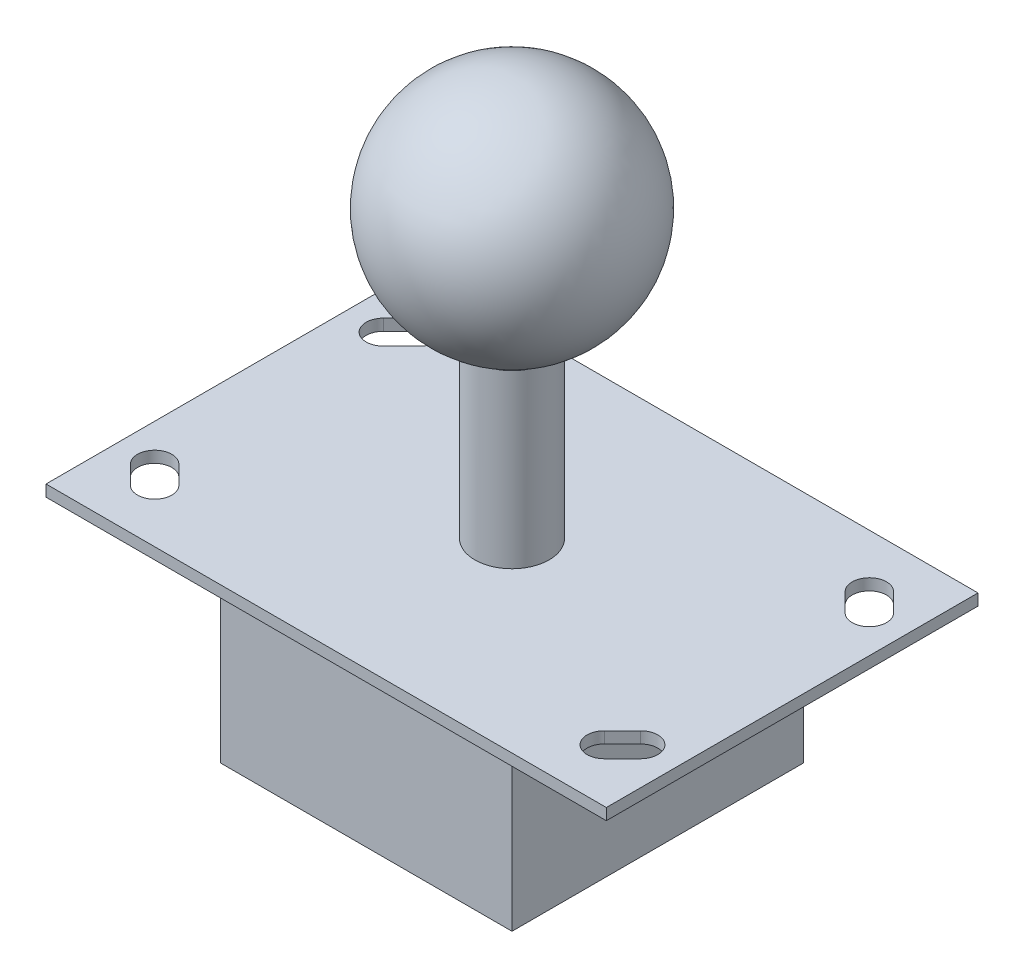
ISO-10303-21;
HEADER;
FILE_DESCRIPTION(('STEP AP214'),'2;1');
FILE_NAME('part.step','',(''),(''),'','','');
FILE_SCHEMA(('AUTOMOTIVE_DESIGN { 1 0 10303 214 1 1 1 1 }'));
ENDSEC;
DATA;
#1=APPLICATION_CONTEXT('core data for automotive mechanical design processes');
#2=APPLICATION_PROTOCOL_DEFINITION('international standard','automotive_design',2000,#1);
#3=PRODUCT_CONTEXT('',#1,'mechanical');
#4=PRODUCT('Part','Part','',(#3));
#5=PRODUCT_RELATED_PRODUCT_CATEGORY('part','',(#4));
#6=PRODUCT_DEFINITION_FORMATION('','',#4);
#7=PRODUCT_DEFINITION_CONTEXT('part definition',#1,'design');
#8=PRODUCT_DEFINITION('design','',#6,#7);
#9=PRODUCT_DEFINITION_SHAPE('','',#8);
#10=(LENGTH_UNIT() NAMED_UNIT(*) SI_UNIT(.MILLI.,.METRE.));
#11=(NAMED_UNIT(*) PLANE_ANGLE_UNIT() SI_UNIT($,.RADIAN.));
#12=(NAMED_UNIT(*) SI_UNIT($,.STERADIAN.) SOLID_ANGLE_UNIT());
#13=UNCERTAINTY_MEASURE_WITH_UNIT(LENGTH_MEASURE(1.E-05),#10,'distance_accuracy_value','');
#14=(GEOMETRIC_REPRESENTATION_CONTEXT(3) GLOBAL_UNCERTAINTY_ASSIGNED_CONTEXT((#13)) GLOBAL_UNIT_ASSIGNED_CONTEXT((#10,
#11,#12)) REPRESENTATION_CONTEXT('',''));
#15=CARTESIAN_POINT('',(0.,0.,0.));
#16=DIRECTION('',(0.,0.,1.));
#17=DIRECTION('',(1.,0.,0.));
#18=AXIS2_PLACEMENT_3D('',#15,#16,#17);
#19=CARTESIAN_POINT('',(0.,50.,0.));
#20=DIRECTION('',(0.,-1.,0.));
#21=DIRECTION('',(-1.,0.,0.));
#22=AXIS2_PLACEMENT_3D('',#19,#20,#21);
#23=SPHERICAL_SURFACE('',#22,20.);
#24=CARTESIAN_POINT('',(0.,30.,0.));
#25=VERTEX_POINT('',#24);
#26=VERTEX_LOOP('',#25);
#27=FACE_BOUND('',#26,.T.);
#28=ADVANCED_FACE('F41',(#27),#23,.T.);
#29=CLOSED_SHELL('',(#28));
#30=MANIFOLD_SOLID_BREP('B2',#29);
#31=CARTESIAN_POINT('',(0.,-2.,0.));
#32=DIRECTION('',(0.,-1.,0.));
#33=DIRECTION('',(0.,0.,-1.));
#34=AXIS2_PLACEMENT_3D('',#31,#32,#33);
#35=PLANE('',#34);
#36=CARTESIAN_POINT('',(-39.3180194846605,-2.,23.1819805153395));
#37=DIRECTION('',(0.,-1.,0.));
#38=DIRECTION('',(0.,0.,-1.));
#39=AXIS2_PLACEMENT_3D('',#36,#37,#38);
#40=CIRCLE('',#39,3.);
#41=CARTESIAN_POINT('',(-37.1966991411009,-2.,21.0606601717798));
#42=VERTEX_POINT('',#41);
#43=CARTESIAN_POINT('',(-41.4393398282202,-2.,25.3033008588991));
#44=VERTEX_POINT('',#43);
#45=EDGE_CURVE('E306',#42,#44,#40,.T.);
#46=ORIENTED_EDGE('',*,*,#45,.F.);
#47=DIRECTION('',(0.707106781186549,0.,0.707106781186546));
#48=VECTOR('',#47,1.);
#49=CARTESIAN_POINT('',(-29.1286796564403,-2.,29.1286796564404));
#50=LINE('',#49,#48);
#51=CARTESIAN_POINT('',(-40.3786796564404,-2.,17.8786796564404));
#52=VERTEX_POINT('',#51);
#53=EDGE_CURVE('E301',#52,#42,#50,.T.);
#54=ORIENTED_EDGE('',*,*,#53,.F.);
#55=CARTESIAN_POINT('',(-42.5,-2.,20.));
#56=DIRECTION('',(0.,-1.,0.));
#57=DIRECTION('',(0.,0.,-1.));
#58=AXIS2_PLACEMENT_3D('',#55,#56,#57);
#59=CIRCLE('',#58,3.);
#60=CARTESIAN_POINT('',(-44.6213203435596,-2.,22.1213203435597));
#61=VERTEX_POINT('',#60);
#62=EDGE_CURVE('E220',#61,#52,#59,.T.);
#63=ORIENTED_EDGE('',*,*,#62,.F.);
#64=DIRECTION('',(-0.70710678118655,0.,-0.707106781186545));
#65=VECTOR('',#64,1.);
#66=CARTESIAN_POINT('',(-33.3713203435595,-2.,33.3713203435597));
#67=LINE('',#66,#65);
#68=EDGE_CURVE('E304',#44,#61,#67,.T.);
#69=ORIENTED_EDGE('',*,*,#68,.F.);
#70=EDGE_LOOP('',(#46,#54,#63,#69));
#71=FACE_BOUND('',#70,.T.);
#72=CARTESIAN_POINT('',(39.3180194846605,-2.,23.1819805153394));
#73=DIRECTION('',(0.,-1.,0.));
#74=DIRECTION('',(0.,0.,-1.));
#75=AXIS2_PLACEMENT_3D('',#72,#73,#74);
#76=CIRCLE('',#75,3.);
#77=CARTESIAN_POINT('',(41.4393398282202,-2.,25.3033008588991));
#78=VERTEX_POINT('',#77);
#79=CARTESIAN_POINT('',(37.1966991411009,-2.,21.0606601717798));
#80=VERTEX_POINT('',#79);
#81=EDGE_CURVE('E299',#78,#80,#76,.T.);
#82=ORIENTED_EDGE('',*,*,#81,.F.);
#83=DIRECTION('',(-0.70710678118655,0.,0.707106781186545));
#84=VECTOR('',#83,1.);
#85=CARTESIAN_POINT('',(33.3713203435595,-2.,33.3713203435597));
#86=LINE('',#85,#84);
#87=CARTESIAN_POINT('',(44.6213203435596,-2.,22.1213203435596));
#88=VERTEX_POINT('',#87);
#89=EDGE_CURVE('E293',#88,#78,#86,.T.);
#90=ORIENTED_EDGE('',*,*,#89,.F.);
#91=CARTESIAN_POINT('',(42.5,-2.,20.));
#92=DIRECTION('',(0.,-1.,0.));
#93=DIRECTION('',(0.,0.,-1.));
#94=AXIS2_PLACEMENT_3D('',#91,#92,#93);
#95=CIRCLE('',#94,3.);
#96=CARTESIAN_POINT('',(40.3786796564404,-2.,17.8786796564404));
#97=VERTEX_POINT('',#96);
#98=EDGE_CURVE('E295',#97,#88,#95,.T.);
#99=ORIENTED_EDGE('',*,*,#98,.F.);
#100=DIRECTION('',(0.707106781186549,0.,-0.707106781186546));
#101=VECTOR('',#100,1.);
#102=CARTESIAN_POINT('',(29.1286796564403,-2.,29.1286796564404));
#103=LINE('',#102,#101);
#104=EDGE_CURVE('E297',#80,#97,#103,.T.);
#105=ORIENTED_EDGE('',*,*,#104,.F.);
#106=EDGE_LOOP('',(#82,#90,#99,#105));
#107=FACE_BOUND('',#106,.T.);
#108=CARTESIAN_POINT('',(42.5,-2.,-20.));
#109=DIRECTION('',(0.,-1.,0.));
#110=DIRECTION('',(0.,0.,-1.));
#111=AXIS2_PLACEMENT_3D('',#108,#109,#110);
#112=CIRCLE('',#111,3.);
#113=CARTESIAN_POINT('',(44.6213203435597,-2.,-22.1213203435596));
#114=VERTEX_POINT('',#113);
#115=CARTESIAN_POINT('',(40.3786796564404,-2.,-17.8786796564404));
#116=VERTEX_POINT('',#115);
#117=EDGE_CURVE('E291',#114,#116,#112,.T.);
#118=ORIENTED_EDGE('',*,*,#117,.F.);
#119=DIRECTION('',(0.70710678118655,0.,0.707106781186545));
#120=VECTOR('',#119,1.);
#121=CARTESIAN_POINT('',(33.3713203435595,-2.,-33.3713203435597));
#122=LINE('',#121,#120);
#123=CARTESIAN_POINT('',(41.4393398282202,-2.,-25.3033008588991));
#124=VERTEX_POINT('',#123);
#125=EDGE_CURVE('E244',#124,#114,#122,.T.);
#126=ORIENTED_EDGE('',*,*,#125,.F.);
#127=CARTESIAN_POINT('',(39.3180194846605,-2.,-23.1819805153394));
#128=DIRECTION('',(0.,-1.,0.));
#129=DIRECTION('',(0.,0.,-1.));
#130=AXIS2_PLACEMENT_3D('',#127,#128,#129);
#131=CIRCLE('',#130,3.);
#132=CARTESIAN_POINT('',(37.1966991411009,-2.,-21.0606601717798));
#133=VERTEX_POINT('',#132);
#134=EDGE_CURVE('E286',#133,#124,#131,.T.);
#135=ORIENTED_EDGE('',*,*,#134,.F.);
#136=DIRECTION('',(-0.707106781186549,0.,-0.707106781186546));
#137=VECTOR('',#136,1.);
#138=CARTESIAN_POINT('',(29.1286796564403,-2.,-29.1286796564404));
#139=LINE('',#138,#137);
#140=EDGE_CURVE('E289',#116,#133,#139,.T.);
#141=ORIENTED_EDGE('',*,*,#140,.F.);
#142=EDGE_LOOP('',(#118,#126,#135,#141));
#143=FACE_BOUND('',#142,.T.);
#144=CARTESIAN_POINT('',(-42.5,-2.,-20.));
#145=DIRECTION('',(0.,-1.,0.));
#146=DIRECTION('',(0.,0.,-1.));
#147=AXIS2_PLACEMENT_3D('',#144,#145,#146);
#148=CIRCLE('',#147,3.);
#149=CARTESIAN_POINT('',(-40.3786796564404,-2.,-17.8786796564404));
#150=VERTEX_POINT('',#149);
#151=CARTESIAN_POINT('',(-44.6213203435596,-2.,-22.1213203435596));
#152=VERTEX_POINT('',#151);
#153=EDGE_CURVE('E335',#150,#152,#148,.T.);
#154=ORIENTED_EDGE('',*,*,#153,.F.);
#155=DIRECTION('',(-0.707106781186549,0.,0.707106781186546));
#156=VECTOR('',#155,1.);
#157=CARTESIAN_POINT('',(-29.1286796564403,-2.,-29.1286796564404));
#158=LINE('',#157,#156);
#159=CARTESIAN_POINT('',(-37.1966991411009,-2.,-21.0606601717798));
#160=VERTEX_POINT('',#159);
#161=EDGE_CURVE('E322',#160,#150,#158,.T.);
#162=ORIENTED_EDGE('',*,*,#161,.F.);
#163=CARTESIAN_POINT('',(-39.3180194846605,-2.,-23.1819805153395));
#164=DIRECTION('',(0.,-1.,0.));
#165=DIRECTION('',(0.,0.,-1.));
#166=AXIS2_PLACEMENT_3D('',#163,#164,#165);
#167=CIRCLE('',#166,3.);
#168=CARTESIAN_POINT('',(-41.4393398282202,-2.,-25.3033008588991));
#169=VERTEX_POINT('',#168);
#170=EDGE_CURVE('E330',#169,#160,#167,.T.);
#171=ORIENTED_EDGE('',*,*,#170,.F.);
#172=DIRECTION('',(0.70710678118655,0.,-0.707106781186545));
#173=VECTOR('',#172,1.);
#174=CARTESIAN_POINT('',(-33.3713203435595,-2.,-33.3713203435597));
#175=LINE('',#174,#173);
#176=EDGE_CURVE('E333',#152,#169,#175,.T.);
#177=ORIENTED_EDGE('',*,*,#176,.F.);
#178=EDGE_LOOP('',(#154,#162,#171,#177));
#179=FACE_BOUND('',#178,.T.);
#180=DIRECTION('',(0.,0.,1.));
#181=VECTOR('',#180,1.);
#182=CARTESIAN_POINT('',(49.,-2.,-32.5));
#183=LINE('',#182,#181);
#184=CARTESIAN_POINT('',(49.,-2.,-32.5));
#185=VERTEX_POINT('',#184);
#186=CARTESIAN_POINT('',(49.,-2.,32.5));
#187=VERTEX_POINT('',#186);
#188=EDGE_CURVE('E367',#185,#187,#183,.T.);
#189=ORIENTED_EDGE('',*,*,#188,.T.);
#190=DIRECTION('',(-1.,0.,0.));
#191=VECTOR('',#190,1.);
#192=CARTESIAN_POINT('',(49.,-2.,32.5));
#193=LINE('',#192,#191);
#194=CARTESIAN_POINT('',(-49.,-2.,32.5));
#195=VERTEX_POINT('',#194);
#196=EDGE_CURVE('E370',#187,#195,#193,.T.);
#197=ORIENTED_EDGE('',*,*,#196,.T.);
#198=DIRECTION('',(0.,0.,-1.));
#199=VECTOR('',#198,1.);
#200=CARTESIAN_POINT('',(-49.,-2.,-32.5));
#201=LINE('',#200,#199);
#202=CARTESIAN_POINT('',(-49.,-2.,-32.5));
#203=VERTEX_POINT('',#202);
#204=EDGE_CURVE('E373',#195,#203,#201,.T.);
#205=ORIENTED_EDGE('',*,*,#204,.T.);
#206=DIRECTION('',(1.,0.,0.));
#207=VECTOR('',#206,1.);
#208=CARTESIAN_POINT('',(49.,-2.,-32.5));
#209=LINE('',#208,#207);
#210=EDGE_CURVE('E375',#203,#185,#209,.T.);
#211=ORIENTED_EDGE('',*,*,#210,.T.);
#212=EDGE_LOOP('',(#189,#197,#205,#211));
#213=FACE_BOUND('',#212,.T.);
#214=DIRECTION('',(1.,0.,0.));
#215=VECTOR('',#214,1.);
#216=CARTESIAN_POINT('',(-25.5,-2.,-25.5));
#217=LINE('',#216,#215);
#218=CARTESIAN_POINT('',(-25.5,-2.,-25.5));
#219=VERTEX_POINT('',#218);
#220=CARTESIAN_POINT('',(25.5,-2.,-25.5));
#221=VERTEX_POINT('',#220);
#222=EDGE_CURVE('E351',#219,#221,#217,.T.);
#223=ORIENTED_EDGE('',*,*,#222,.F.);
#224=DIRECTION('',(0.,0.,-1.));
#225=VECTOR('',#224,1.);
#226=CARTESIAN_POINT('',(-25.5,-2.,25.5));
#227=LINE('',#226,#225);
#228=CARTESIAN_POINT('',(-25.5,-2.,25.5));
#229=VERTEX_POINT('',#228);
#230=EDGE_CURVE('E337',#229,#219,#227,.T.);
#231=ORIENTED_EDGE('',*,*,#230,.F.);
#232=DIRECTION('',(-1.,0.,0.));
#233=VECTOR('',#232,1.);
#234=CARTESIAN_POINT('',(-25.5,-2.,25.5));
#235=LINE('',#234,#233);
#236=CARTESIAN_POINT('',(25.5,-2.,25.5));
#237=VERTEX_POINT('',#236);
#238=EDGE_CURVE('E342',#237,#229,#235,.T.);
#239=ORIENTED_EDGE('',*,*,#238,.F.);
#240=DIRECTION('',(0.,0.,1.));
#241=VECTOR('',#240,1.);
#242=CARTESIAN_POINT('',(25.5,-2.,25.5));
#243=LINE('',#242,#241);
#244=EDGE_CURVE('E353',#221,#237,#243,.T.);
#245=ORIENTED_EDGE('',*,*,#244,.F.);
#246=EDGE_LOOP('',(#223,#231,#239,#245));
#247=FACE_BOUND('',#246,.T.);
#248=ADVANCED_FACE('F54',(#71,#107,#143,#179,#213,#247),#35,.T.);
#249=CARTESIAN_POINT('',(0.,30.,0.));
#250=DIRECTION('',(0.,-1.,0.));
#251=DIRECTION('',(0.,0.,-1.));
#252=AXIS2_PLACEMENT_3D('',#249,#250,#251);
#253=CYLINDRICAL_SURFACE('',#252,6.5);
#254=CARTESIAN_POINT('',(0.,30.,0.));
#255=DIRECTION('',(0.,1.,0.));
#256=DIRECTION('',(0.,0.,1.));
#257=AXIS2_PLACEMENT_3D('',#254,#255,#256);
#258=CIRCLE('',#257,6.5);
#259=CARTESIAN_POINT('',(0.,30.,6.5));
#260=VERTEX_POINT('',#259);
#261=EDGE_CURVE('E39',#260,#260,#258,.T.);
#262=ORIENTED_EDGE('',*,*,#261,.F.);
#263=EDGE_LOOP('',(#262));
#264=FACE_BOUND('',#263,.T.);
#265=CARTESIAN_POINT('',(0.,0.,0.));
#266=DIRECTION('',(0.,-1.,0.));
#267=DIRECTION('',(0.,0.,-1.));
#268=AXIS2_PLACEMENT_3D('',#265,#266,#267);
#269=CIRCLE('',#268,6.5);
#270=CARTESIAN_POINT('',(0.,0.,-6.5));
#271=VERTEX_POINT('',#270);
#272=EDGE_CURVE('E62',#271,#271,#269,.T.);
#273=ORIENTED_EDGE('',*,*,#272,.F.);
#274=EDGE_LOOP('',(#273));
#275=FACE_BOUND('',#274,.T.);
#276=ADVANCED_FACE('F56',(#264,#275),#253,.T.);
#277=CARTESIAN_POINT('',(0.,30.,0.));
#278=DIRECTION('',(0.,1.,0.));
#279=DIRECTION('',(0.,0.,1.));
#280=AXIS2_PLACEMENT_3D('',#277,#278,#279);
#281=PLANE('',#280);
#282=ORIENTED_EDGE('',*,*,#261,.T.);
#283=EDGE_LOOP('',(#282));
#284=FACE_BOUND('',#283,.T.);
#285=ADVANCED_FACE('F401',(#284),#281,.T.);
#286=CARTESIAN_POINT('',(49.,-2.,-32.5));
#287=DIRECTION('',(-1.,0.,0.));
#288=DIRECTION('',(0.,0.,1.));
#289=AXIS2_PLACEMENT_3D('',#286,#287,#288);
#290=PLANE('',#289);
#291=DIRECTION('',(0.,0.,1.));
#292=VECTOR('',#291,1.);
#293=CARTESIAN_POINT('',(49.,0.,-32.5));
#294=LINE('',#293,#292);
#295=CARTESIAN_POINT('',(49.,0.,-32.5));
#296=VERTEX_POINT('',#295);
#297=CARTESIAN_POINT('',(49.,0.,32.5));
#298=VERTEX_POINT('',#297);
#299=EDGE_CURVE('E366',#296,#298,#294,.T.);
#300=ORIENTED_EDGE('',*,*,#299,.T.);
#301=DIRECTION('',(0.,1.,0.));
#302=VECTOR('',#301,1.);
#303=CARTESIAN_POINT('',(49.,-2.,32.5));
#304=LINE('',#303,#302);
#305=EDGE_CURVE('E393',#187,#298,#304,.T.);
#306=ORIENTED_EDGE('',*,*,#305,.F.);
#307=ORIENTED_EDGE('',*,*,#188,.F.);
#308=DIRECTION('',(0.,1.,0.));
#309=VECTOR('',#308,1.);
#310=CARTESIAN_POINT('',(49.,-2.,-32.5));
#311=LINE('',#310,#309);
#312=EDGE_CURVE('E377',#185,#296,#311,.T.);
#313=ORIENTED_EDGE('',*,*,#312,.T.);
#314=EDGE_LOOP('',(#300,#306,#307,#313));
#315=FACE_BOUND('',#314,.T.);
#316=ADVANCED_FACE('F407',(#315),#290,.F.);
#317=CARTESIAN_POINT('',(49.,-2.,32.5));
#318=DIRECTION('',(0.,0.,-1.));
#319=DIRECTION('',(-1.,0.,0.));
#320=AXIS2_PLACEMENT_3D('',#317,#318,#319);
#321=PLANE('',#320);
#322=DIRECTION('',(-1.,0.,0.));
#323=VECTOR('',#322,1.);
#324=CARTESIAN_POINT('',(49.,0.,32.5));
#325=LINE('',#324,#323);
#326=CARTESIAN_POINT('',(-49.,0.,32.5));
#327=VERTEX_POINT('',#326);
#328=EDGE_CURVE('E380',#298,#327,#325,.T.);
#329=ORIENTED_EDGE('',*,*,#328,.T.);
#330=DIRECTION('',(0.,1.,0.));
#331=VECTOR('',#330,1.);
#332=CARTESIAN_POINT('',(-49.,-2.,32.5));
#333=LINE('',#332,#331);
#334=EDGE_CURVE('E390',#195,#327,#333,.T.);
#335=ORIENTED_EDGE('',*,*,#334,.F.);
#336=ORIENTED_EDGE('',*,*,#196,.F.);
#337=ORIENTED_EDGE('',*,*,#305,.T.);
#338=EDGE_LOOP('',(#329,#335,#336,#337));
#339=FACE_BOUND('',#338,.T.);
#340=ADVANCED_FACE('F429',(#339),#321,.F.);
#341=CARTESIAN_POINT('',(-49.,-2.,-32.5));
#342=DIRECTION('',(1.,0.,0.));
#343=DIRECTION('',(0.,0.,-1.));
#344=AXIS2_PLACEMENT_3D('',#341,#342,#343);
#345=PLANE('',#344);
#346=DIRECTION('',(0.,0.,-1.));
#347=VECTOR('',#346,1.);
#348=CARTESIAN_POINT('',(-49.,0.,-32.5));
#349=LINE('',#348,#347);
#350=CARTESIAN_POINT('',(-49.,0.,-32.5));
#351=VERTEX_POINT('',#350);
#352=EDGE_CURVE('E382',#327,#351,#349,.T.);
#353=ORIENTED_EDGE('',*,*,#352,.T.);
#354=DIRECTION('',(0.,1.,0.));
#355=VECTOR('',#354,1.);
#356=CARTESIAN_POINT('',(-49.,-2.,-32.5));
#357=LINE('',#356,#355);
#358=EDGE_CURVE('E387',#203,#351,#357,.T.);
#359=ORIENTED_EDGE('',*,*,#358,.F.);
#360=ORIENTED_EDGE('',*,*,#204,.F.);
#361=ORIENTED_EDGE('',*,*,#334,.T.);
#362=EDGE_LOOP('',(#353,#359,#360,#361));
#363=FACE_BOUND('',#362,.T.);
#364=ADVANCED_FACE('F425',(#363),#345,.F.);
#365=CARTESIAN_POINT('',(49.,-2.,-32.5));
#366=DIRECTION('',(0.,0.,1.));
#367=DIRECTION('',(1.,0.,0.));
#368=AXIS2_PLACEMENT_3D('',#365,#366,#367);
#369=PLANE('',#368);
#370=DIRECTION('',(1.,0.,0.));
#371=VECTOR('',#370,1.);
#372=CARTESIAN_POINT('',(49.,0.,-32.5));
#373=LINE('',#372,#371);
#374=EDGE_CURVE('E371',#351,#296,#373,.T.);
#375=ORIENTED_EDGE('',*,*,#374,.T.);
#376=ORIENTED_EDGE('',*,*,#312,.F.);
#377=ORIENTED_EDGE('',*,*,#210,.F.);
#378=ORIENTED_EDGE('',*,*,#358,.T.);
#379=EDGE_LOOP('',(#375,#376,#377,#378));
#380=FACE_BOUND('',#379,.T.);
#381=ADVANCED_FACE('F422',(#380),#369,.F.);
#382=CARTESIAN_POINT('',(0.,0.,0.));
#383=DIRECTION('',(0.,-1.,0.));
#384=DIRECTION('',(0.,0.,-1.));
#385=AXIS2_PLACEMENT_3D('',#382,#383,#384);
#386=PLANE('',#385);
#387=DIRECTION('',(-0.707106781186549,0.,-0.707106781186546));
#388=VECTOR('',#387,1.);
#389=CARTESIAN_POINT('',(-40.3786796564404,0.,17.8786796564404));
#390=LINE('',#389,#388);
#391=CARTESIAN_POINT('',(-37.1966991411009,0.,21.0606601717798));
#392=VERTEX_POINT('',#391);
#393=CARTESIAN_POINT('',(-40.3786796564404,0.,17.8786796564404));
#394=VERTEX_POINT('',#393);
#395=EDGE_CURVE('E227',#392,#394,#390,.T.);
#396=ORIENTED_EDGE('',*,*,#395,.F.);
#397=CARTESIAN_POINT('',(-39.3180194846605,0.,23.1819805153395));
#398=DIRECTION('',(0.,1.,0.));
#399=DIRECTION('',(0.,0.,-1.));
#400=AXIS2_PLACEMENT_3D('',#397,#398,#399);
#401=CIRCLE('',#400,3.);
#402=CARTESIAN_POINT('',(-41.4393398282202,0.,25.3033008588991));
#403=VERTEX_POINT('',#402);
#404=EDGE_CURVE('E232',#403,#392,#401,.T.);
#405=ORIENTED_EDGE('',*,*,#404,.F.);
#406=DIRECTION('',(0.70710678118655,0.,0.707106781186545));
#407=VECTOR('',#406,1.);
#408=CARTESIAN_POINT('',(-44.6213203435596,0.,22.1213203435596));
#409=LINE('',#408,#407);
#410=CARTESIAN_POINT('',(-44.6213203435596,0.,22.1213203435597));
#411=VERTEX_POINT('',#410);
#412=EDGE_CURVE('E237',#411,#403,#409,.T.);
#413=ORIENTED_EDGE('',*,*,#412,.F.);
#414=CARTESIAN_POINT('',(-42.5,0.,20.));
#415=DIRECTION('',(0.,1.,0.));
#416=DIRECTION('',(0.,0.,-1.));
#417=AXIS2_PLACEMENT_3D('',#414,#415,#416);
#418=CIRCLE('',#417,3.);
#419=EDGE_CURVE('E217',#394,#411,#418,.T.);
#420=ORIENTED_EDGE('',*,*,#419,.F.);
#421=EDGE_LOOP('',(#396,#405,#413,#420));
#422=FACE_BOUND('',#421,.T.);
#423=DIRECTION('',(0.70710678118655,0.,-0.707106781186545));
#424=VECTOR('',#423,1.);
#425=CARTESIAN_POINT('',(44.6213203435597,0.,22.1213203435596));
#426=LINE('',#425,#424);
#427=CARTESIAN_POINT('',(41.4393398282202,0.,25.3033008588991));
#428=VERTEX_POINT('',#427);
#429=CARTESIAN_POINT('',(44.6213203435597,0.,22.1213203435596));
#430=VERTEX_POINT('',#429);
#431=EDGE_CURVE('E249',#428,#430,#426,.T.);
#432=ORIENTED_EDGE('',*,*,#431,.F.);
#433=CARTESIAN_POINT('',(39.3180194846605,0.,23.1819805153394));
#434=DIRECTION('',(0.,1.,0.));
#435=DIRECTION('',(0.,0.,1.));
#436=AXIS2_PLACEMENT_3D('',#433,#434,#435);
#437=CIRCLE('',#436,3.);
#438=CARTESIAN_POINT('',(37.1966991411009,0.,21.0606601717798));
#439=VERTEX_POINT('',#438);
#440=EDGE_CURVE('E247',#439,#428,#437,.T.);
#441=ORIENTED_EDGE('',*,*,#440,.F.);
#442=DIRECTION('',(-0.707106781186549,0.,0.707106781186546));
#443=VECTOR('',#442,1.);
#444=CARTESIAN_POINT('',(40.3786796564404,0.,17.8786796564404));
#445=LINE('',#444,#443);
#446=CARTESIAN_POINT('',(40.3786796564404,0.,17.8786796564404));
#447=VERTEX_POINT('',#446);
#448=EDGE_CURVE('E255',#447,#439,#445,.T.);
#449=ORIENTED_EDGE('',*,*,#448,.F.);
#450=CARTESIAN_POINT('',(42.5,0.,20.));
#451=DIRECTION('',(0.,1.,0.));
#452=DIRECTION('',(0.,0.,1.));
#453=AXIS2_PLACEMENT_3D('',#450,#451,#452);
#454=CIRCLE('',#453,3.);
#455=EDGE_CURVE('E252',#430,#447,#454,.T.);
#456=ORIENTED_EDGE('',*,*,#455,.F.);
#457=EDGE_LOOP('',(#432,#441,#449,#456));
#458=FACE_BOUND('',#457,.T.);
#459=DIRECTION('',(-0.70710678118655,0.,-0.707106781186545));
#460=VECTOR('',#459,1.);
#461=CARTESIAN_POINT('',(44.6213203435597,0.,-22.1213203435596));
#462=LINE('',#461,#460);
#463=CARTESIAN_POINT('',(44.6213203435596,0.,-22.1213203435596));
#464=VERTEX_POINT('',#463);
#465=CARTESIAN_POINT('',(41.4393398282202,0.,-25.3033008588991));
#466=VERTEX_POINT('',#465);
#467=EDGE_CURVE('E268',#464,#466,#462,.T.);
#468=ORIENTED_EDGE('',*,*,#467,.F.);
#469=CARTESIAN_POINT('',(42.5,0.,-20.));
#470=DIRECTION('',(0.,1.,0.));
#471=DIRECTION('',(0.,0.,-1.));
#472=AXIS2_PLACEMENT_3D('',#469,#470,#471);
#473=CIRCLE('',#472,3.);
#474=CARTESIAN_POINT('',(40.3786796564404,0.,-17.8786796564404));
#475=VERTEX_POINT('',#474);
#476=EDGE_CURVE('E266',#475,#464,#473,.T.);
#477=ORIENTED_EDGE('',*,*,#476,.F.);
#478=DIRECTION('',(0.707106781186549,0.,0.707106781186546));
#479=VECTOR('',#478,1.);
#480=CARTESIAN_POINT('',(40.3786796564404,0.,-17.8786796564404));
#481=LINE('',#480,#479);
#482=CARTESIAN_POINT('',(37.1966991411009,0.,-21.0606601717798));
#483=VERTEX_POINT('',#482);
#484=EDGE_CURVE('E274',#483,#475,#481,.T.);
#485=ORIENTED_EDGE('',*,*,#484,.F.);
#486=CARTESIAN_POINT('',(39.3180194846605,0.,-23.1819805153394));
#487=DIRECTION('',(0.,1.,0.));
#488=DIRECTION('',(0.,0.,-1.));
#489=AXIS2_PLACEMENT_3D('',#486,#487,#488);
#490=CIRCLE('',#489,3.);
#491=EDGE_CURVE('E271',#466,#483,#490,.T.);
#492=ORIENTED_EDGE('',*,*,#491,.F.);
#493=EDGE_LOOP('',(#468,#477,#485,#492));
#494=FACE_BOUND('',#493,.T.);
#495=DIRECTION('',(0.707106781186549,0.,-0.707106781186546));
#496=VECTOR('',#495,1.);
#497=CARTESIAN_POINT('',(-40.3786796564404,0.,-17.8786796564404));
#498=LINE('',#497,#496);
#499=CARTESIAN_POINT('',(-40.3786796564404,0.,-17.8786796564404));
#500=VERTEX_POINT('',#499);
#501=CARTESIAN_POINT('',(-37.1966991411009,0.,-21.0606601717798));
#502=VERTEX_POINT('',#501);
#503=EDGE_CURVE('E310',#500,#502,#498,.T.);
#504=ORIENTED_EDGE('',*,*,#503,.F.);
#505=CARTESIAN_POINT('',(-42.5,0.,-20.));
#506=DIRECTION('',(0.,1.,0.));
#507=DIRECTION('',(0.,0.,1.));
#508=AXIS2_PLACEMENT_3D('',#505,#506,#507);
#509=CIRCLE('',#508,3.);
#510=CARTESIAN_POINT('',(-44.6213203435596,0.,-22.1213203435596));
#511=VERTEX_POINT('',#510);
#512=EDGE_CURVE('E308',#511,#500,#509,.T.);
#513=ORIENTED_EDGE('',*,*,#512,.F.);
#514=DIRECTION('',(-0.70710678118655,0.,0.707106781186545));
#515=VECTOR('',#514,1.);
#516=CARTESIAN_POINT('',(-44.6213203435596,0.,-22.1213203435596));
#517=LINE('',#516,#515);
#518=CARTESIAN_POINT('',(-41.4393398282202,0.,-25.3033008588991));
#519=VERTEX_POINT('',#518);
#520=EDGE_CURVE('E316',#519,#511,#517,.T.);
#521=ORIENTED_EDGE('',*,*,#520,.F.);
#522=CARTESIAN_POINT('',(-39.3180194846605,0.,-23.1819805153395));
#523=DIRECTION('',(0.,1.,0.));
#524=DIRECTION('',(0.,0.,1.));
#525=AXIS2_PLACEMENT_3D('',#522,#523,#524);
#526=CIRCLE('',#525,3.);
#527=EDGE_CURVE('E313',#502,#519,#526,.T.);
#528=ORIENTED_EDGE('',*,*,#527,.F.);
#529=EDGE_LOOP('',(#504,#513,#521,#528));
#530=FACE_BOUND('',#529,.T.);
#531=ORIENTED_EDGE('',*,*,#272,.T.);
#532=EDGE_LOOP('',(#531));
#533=FACE_BOUND('',#532,.T.);
#534=ORIENTED_EDGE('',*,*,#299,.F.);
#535=ORIENTED_EDGE('',*,*,#374,.F.);
#536=ORIENTED_EDGE('',*,*,#352,.F.);
#537=ORIENTED_EDGE('',*,*,#328,.F.);
#538=EDGE_LOOP('',(#534,#535,#536,#537));
#539=FACE_BOUND('',#538,.T.);
#540=ADVANCED_FACE('F234',(#422,#458,#494,#530,#533,#539),#386,.F.);
#541=CARTESIAN_POINT('',(-25.5,-34.,25.5));
#542=DIRECTION('',(1.,0.,0.));
#543=DIRECTION('',(0.,0.,-1.));
#544=AXIS2_PLACEMENT_3D('',#541,#542,#543);
#545=PLANE('',#544);
#546=ORIENTED_EDGE('',*,*,#230,.T.);
#547=DIRECTION('',(0.,1.,0.));
#548=VECTOR('',#547,1.);
#549=CARTESIAN_POINT('',(-25.5,-34.,-25.5));
#550=LINE('',#549,#548);
#551=CARTESIAN_POINT('',(-25.5,-34.,-25.5));
#552=VERTEX_POINT('',#551);
#553=EDGE_CURVE('E364',#552,#219,#550,.T.);
#554=ORIENTED_EDGE('',*,*,#553,.F.);
#555=DIRECTION('',(0.,0.,-1.));
#556=VECTOR('',#555,1.);
#557=CARTESIAN_POINT('',(-25.5,-34.,25.5));
#558=LINE('',#557,#556);
#559=CARTESIAN_POINT('',(-25.5,-34.,25.5));
#560=VERTEX_POINT('',#559);
#561=EDGE_CURVE('E338',#560,#552,#558,.T.);
#562=ORIENTED_EDGE('',*,*,#561,.F.);
#563=DIRECTION('',(0.,1.,0.));
#564=VECTOR('',#563,1.);
#565=CARTESIAN_POINT('',(-25.5,-34.,25.5));
#566=LINE('',#565,#564);
#567=EDGE_CURVE('E348',#560,#229,#566,.T.);
#568=ORIENTED_EDGE('',*,*,#567,.T.);
#569=EDGE_LOOP('',(#546,#554,#562,#568));
#570=FACE_BOUND('',#569,.T.);
#571=ADVANCED_FACE('F418',(#570),#545,.F.);
#572=CARTESIAN_POINT('',(-25.5,-34.,-25.5));
#573=DIRECTION('',(0.,0.,1.));
#574=DIRECTION('',(1.,0.,0.));
#575=AXIS2_PLACEMENT_3D('',#572,#573,#574);
#576=PLANE('',#575);
#577=ORIENTED_EDGE('',*,*,#222,.T.);
#578=DIRECTION('',(0.,1.,0.));
#579=VECTOR('',#578,1.);
#580=CARTESIAN_POINT('',(25.5,-34.,-25.5));
#581=LINE('',#580,#579);
#582=CARTESIAN_POINT('',(25.5,-34.,-25.5));
#583=VERTEX_POINT('',#582);
#584=EDGE_CURVE('E361',#583,#221,#581,.T.);
#585=ORIENTED_EDGE('',*,*,#584,.F.);
#586=DIRECTION('',(1.,0.,0.));
#587=VECTOR('',#586,1.);
#588=CARTESIAN_POINT('',(-25.5,-34.,-25.5));
#589=LINE('',#588,#587);
#590=EDGE_CURVE('E341',#552,#583,#589,.T.);
#591=ORIENTED_EDGE('',*,*,#590,.F.);
#592=ORIENTED_EDGE('',*,*,#553,.T.);
#593=EDGE_LOOP('',(#577,#585,#591,#592));
#594=FACE_BOUND('',#593,.T.);
#595=ADVANCED_FACE('F456',(#594),#576,.F.);
#596=CARTESIAN_POINT('',(25.5,-34.,25.5));
#597=DIRECTION('',(-1.,0.,0.));
#598=DIRECTION('',(0.,0.,1.));
#599=AXIS2_PLACEMENT_3D('',#596,#597,#598);
#600=PLANE('',#599);
#601=ORIENTED_EDGE('',*,*,#244,.T.);
#602=DIRECTION('',(0.,1.,0.));
#603=VECTOR('',#602,1.);
#604=CARTESIAN_POINT('',(25.5,-34.,25.5));
#605=LINE('',#604,#603);
#606=CARTESIAN_POINT('',(25.5,-34.,25.5));
#607=VERTEX_POINT('',#606);
#608=EDGE_CURVE('E359',#607,#237,#605,.T.);
#609=ORIENTED_EDGE('',*,*,#608,.F.);
#610=DIRECTION('',(0.,0.,1.));
#611=VECTOR('',#610,1.);
#612=CARTESIAN_POINT('',(25.5,-34.,25.5));
#613=LINE('',#612,#611);
#614=EDGE_CURVE('E344',#583,#607,#613,.T.);
#615=ORIENTED_EDGE('',*,*,#614,.F.);
#616=ORIENTED_EDGE('',*,*,#584,.T.);
#617=EDGE_LOOP('',(#601,#609,#615,#616));
#618=FACE_BOUND('',#617,.T.);
#619=ADVANCED_FACE('F460',(#618),#600,.F.);
#620=CARTESIAN_POINT('',(-25.5,-34.,25.5));
#621=DIRECTION('',(0.,0.,-1.));
#622=DIRECTION('',(-1.,0.,0.));
#623=AXIS2_PLACEMENT_3D('',#620,#621,#622);
#624=PLANE('',#623);
#625=ORIENTED_EDGE('',*,*,#238,.T.);
#626=ORIENTED_EDGE('',*,*,#567,.F.);
#627=DIRECTION('',(-1.,0.,0.));
#628=VECTOR('',#627,1.);
#629=CARTESIAN_POINT('',(-25.5,-34.,25.5));
#630=LINE('',#629,#628);
#631=EDGE_CURVE('E346',#607,#560,#630,.T.);
#632=ORIENTED_EDGE('',*,*,#631,.F.);
#633=ORIENTED_EDGE('',*,*,#608,.T.);
#634=EDGE_LOOP('',(#625,#626,#632,#633));
#635=FACE_BOUND('',#634,.T.);
#636=ADVANCED_FACE('F469',(#635),#624,.F.);
#637=CARTESIAN_POINT('',(0.,-34.,0.));
#638=DIRECTION('',(0.,-1.,0.));
#639=DIRECTION('',(0.,0.,-1.));
#640=AXIS2_PLACEMENT_3D('',#637,#638,#639);
#641=PLANE('',#640);
#642=ORIENTED_EDGE('',*,*,#561,.T.);
#643=ORIENTED_EDGE('',*,*,#590,.T.);
#644=ORIENTED_EDGE('',*,*,#614,.T.);
#645=ORIENTED_EDGE('',*,*,#631,.T.);
#646=EDGE_LOOP('',(#642,#643,#644,#645));
#647=FACE_BOUND('',#646,.T.);
#648=ADVANCED_FACE('F464',(#647),#641,.T.);
#649=CARTESIAN_POINT('',(-42.5,-34.,-20.));
#650=DIRECTION('',(0.,1.,0.));
#651=DIRECTION('',(0.,0.,1.));
#652=AXIS2_PLACEMENT_3D('',#649,#650,#651);
#653=CYLINDRICAL_SURFACE('',#652,3.);
#654=ORIENTED_EDGE('',*,*,#153,.T.);
#655=DIRECTION('',(0.,1.,0.));
#656=VECTOR('',#655,1.);
#657=CARTESIAN_POINT('',(-44.6213203435596,-34.,-22.1213203435596));
#658=LINE('',#657,#656);
#659=EDGE_CURVE('E320',#152,#511,#658,.T.);
#660=ORIENTED_EDGE('',*,*,#659,.T.);
#661=ORIENTED_EDGE('',*,*,#512,.T.);
#662=DIRECTION('',(0.,1.,0.));
#663=VECTOR('',#662,1.);
#664=CARTESIAN_POINT('',(-40.3786796564404,-34.,-17.8786796564404));
#665=LINE('',#664,#663);
#666=EDGE_CURVE('E319',#150,#500,#665,.T.);
#667=ORIENTED_EDGE('',*,*,#666,.F.);
#668=EDGE_LOOP('',(#654,#660,#661,#667));
#669=FACE_BOUND('',#668,.T.);
#670=ADVANCED_FACE('F476',(#669),#653,.F.);
#671=CARTESIAN_POINT('',(-44.6213203435596,-34.,-22.1213203435596));
#672=DIRECTION('',(-0.707106781186545,0.,-0.70710678118655));
#673=DIRECTION('',(-0.70710678118655,0.,0.707106781186545));
#674=AXIS2_PLACEMENT_3D('',#671,#672,#673);
#675=PLANE('',#674);
#676=ORIENTED_EDGE('',*,*,#176,.T.);
#677=DIRECTION('',(0.,1.,0.));
#678=VECTOR('',#677,1.);
#679=CARTESIAN_POINT('',(-41.4393398282202,-34.,-25.3033008588991));
#680=LINE('',#679,#678);
#681=EDGE_CURVE('E323',#169,#519,#680,.T.);
#682=ORIENTED_EDGE('',*,*,#681,.T.);
#683=ORIENTED_EDGE('',*,*,#520,.T.);
#684=ORIENTED_EDGE('',*,*,#659,.F.);
#685=EDGE_LOOP('',(#676,#682,#683,#684));
#686=FACE_BOUND('',#685,.T.);
#687=ADVANCED_FACE('F556',(#686),#675,.F.);
#688=CARTESIAN_POINT('',(-39.3180194846605,-34.,-23.1819805153395));
#689=DIRECTION('',(0.,1.,0.));
#690=DIRECTION('',(0.,0.,1.));
#691=AXIS2_PLACEMENT_3D('',#688,#689,#690);
#692=CYLINDRICAL_SURFACE('',#691,3.);
#693=ORIENTED_EDGE('',*,*,#170,.T.);
#694=DIRECTION('',(0.,1.,0.));
#695=VECTOR('',#694,1.);
#696=CARTESIAN_POINT('',(-37.1966991411009,-34.,-21.0606601717798));
#697=LINE('',#696,#695);
#698=EDGE_CURVE('E325',#160,#502,#697,.T.);
#699=ORIENTED_EDGE('',*,*,#698,.T.);
#700=ORIENTED_EDGE('',*,*,#527,.T.);
#701=ORIENTED_EDGE('',*,*,#681,.F.);
#702=EDGE_LOOP('',(#693,#699,#700,#701));
#703=FACE_BOUND('',#702,.T.);
#704=ADVANCED_FACE('F564',(#703),#692,.F.);
#705=CARTESIAN_POINT('',(-40.3786796564404,-34.,-17.8786796564404));
#706=DIRECTION('',(0.707106781186546,0.,0.70710678118655));
#707=DIRECTION('',(0.707106781186549,0.,-0.707106781186546));
#708=AXIS2_PLACEMENT_3D('',#705,#706,#707);
#709=PLANE('',#708);
#710=ORIENTED_EDGE('',*,*,#161,.T.);
#711=ORIENTED_EDGE('',*,*,#666,.T.);
#712=ORIENTED_EDGE('',*,*,#503,.T.);
#713=ORIENTED_EDGE('',*,*,#698,.F.);
#714=EDGE_LOOP('',(#710,#711,#712,#713));
#715=FACE_BOUND('',#714,.T.);
#716=ADVANCED_FACE('F573',(#715),#709,.F.);
#717=CARTESIAN_POINT('',(42.5,-34.,-20.));
#718=DIRECTION('',(0.,1.,0.));
#719=DIRECTION('',(0.,0.,1.));
#720=AXIS2_PLACEMENT_3D('',#717,#718,#719);
#721=CYLINDRICAL_SURFACE('',#720,3.);
#722=ORIENTED_EDGE('',*,*,#117,.T.);
#723=DIRECTION('',(0.,1.,0.));
#724=VECTOR('',#723,1.);
#725=CARTESIAN_POINT('',(40.3786796564404,-34.,-17.8786796564404));
#726=LINE('',#725,#724);
#727=EDGE_CURVE('E250',#116,#475,#726,.T.);
#728=ORIENTED_EDGE('',*,*,#727,.T.);
#729=ORIENTED_EDGE('',*,*,#476,.T.);
#730=DIRECTION('',(0.,1.,0.));
#731=VECTOR('',#730,1.);
#732=CARTESIAN_POINT('',(44.6213203435597,-34.,-22.1213203435596));
#733=LINE('',#732,#731);
#734=EDGE_CURVE('E277',#114,#464,#733,.T.);
#735=ORIENTED_EDGE('',*,*,#734,.F.);
#736=EDGE_LOOP('',(#722,#728,#729,#735));
#737=FACE_BOUND('',#736,.T.);
#738=ADVANCED_FACE('F582',(#737),#721,.F.);
#739=CARTESIAN_POINT('',(40.3786796564404,-34.,-17.8786796564404));
#740=DIRECTION('',(-0.707106781186546,0.,0.70710678118655));
#741=DIRECTION('',(0.707106781186549,0.,0.707106781186546));
#742=AXIS2_PLACEMENT_3D('',#739,#740,#741);
#743=PLANE('',#742);
#744=ORIENTED_EDGE('',*,*,#140,.T.);
#745=DIRECTION('',(0.,1.,0.));
#746=VECTOR('',#745,1.);
#747=CARTESIAN_POINT('',(37.1966991411009,-34.,-21.0606601717798));
#748=LINE('',#747,#746);
#749=EDGE_CURVE('E279',#133,#483,#748,.T.);
#750=ORIENTED_EDGE('',*,*,#749,.T.);
#751=ORIENTED_EDGE('',*,*,#484,.T.);
#752=ORIENTED_EDGE('',*,*,#727,.F.);
#753=EDGE_LOOP('',(#744,#750,#751,#752));
#754=FACE_BOUND('',#753,.T.);
#755=ADVANCED_FACE('F591',(#754),#743,.F.);
#756=CARTESIAN_POINT('',(39.3180194846605,-34.,-23.1819805153394));
#757=DIRECTION('',(0.,1.,0.));
#758=DIRECTION('',(0.,0.,1.));
#759=AXIS2_PLACEMENT_3D('',#756,#757,#758);
#760=CYLINDRICAL_SURFACE('',#759,3.);
#761=ORIENTED_EDGE('',*,*,#134,.T.);
#762=DIRECTION('',(0.,1.,0.));
#763=VECTOR('',#762,1.);
#764=CARTESIAN_POINT('',(41.4393398282202,-34.,-25.3033008588991));
#765=LINE('',#764,#763);
#766=EDGE_CURVE('E281',#124,#466,#765,.T.);
#767=ORIENTED_EDGE('',*,*,#766,.T.);
#768=ORIENTED_EDGE('',*,*,#491,.T.);
#769=ORIENTED_EDGE('',*,*,#749,.F.);
#770=EDGE_LOOP('',(#761,#767,#768,#769));
#771=FACE_BOUND('',#770,.T.);
#772=ADVANCED_FACE('F600',(#771),#760,.F.);
#773=CARTESIAN_POINT('',(44.6213203435597,-34.,-22.1213203435596));
#774=DIRECTION('',(0.707106781186545,0.,-0.70710678118655));
#775=DIRECTION('',(-0.70710678118655,0.,-0.707106781186545));
#776=AXIS2_PLACEMENT_3D('',#773,#774,#775);
#777=PLANE('',#776);
#778=ORIENTED_EDGE('',*,*,#125,.T.);
#779=ORIENTED_EDGE('',*,*,#734,.T.);
#780=ORIENTED_EDGE('',*,*,#467,.T.);
#781=ORIENTED_EDGE('',*,*,#766,.F.);
#782=EDGE_LOOP('',(#778,#779,#780,#781));
#783=FACE_BOUND('',#782,.T.);
#784=ADVANCED_FACE('F609',(#783),#777,.F.);
#785=CARTESIAN_POINT('',(39.3180194846605,-34.,23.1819805153394));
#786=DIRECTION('',(0.,1.,0.));
#787=DIRECTION('',(0.,0.,1.));
#788=AXIS2_PLACEMENT_3D('',#785,#786,#787);
#789=CYLINDRICAL_SURFACE('',#788,3.);
#790=ORIENTED_EDGE('',*,*,#81,.T.);
#791=DIRECTION('',(0.,1.,0.));
#792=VECTOR('',#791,1.);
#793=CARTESIAN_POINT('',(37.1966991411009,-34.,21.0606601717798));
#794=LINE('',#793,#792);
#795=EDGE_CURVE('E259',#80,#439,#794,.T.);
#796=ORIENTED_EDGE('',*,*,#795,.T.);
#797=ORIENTED_EDGE('',*,*,#440,.T.);
#798=DIRECTION('',(0.,1.,0.));
#799=VECTOR('',#798,1.);
#800=CARTESIAN_POINT('',(41.4393398282202,-34.,25.3033008588991));
#801=LINE('',#800,#799);
#802=EDGE_CURVE('E258',#78,#428,#801,.T.);
#803=ORIENTED_EDGE('',*,*,#802,.F.);
#804=EDGE_LOOP('',(#790,#796,#797,#803));
#805=FACE_BOUND('',#804,.T.);
#806=ADVANCED_FACE('F618',(#805),#789,.F.);
#807=CARTESIAN_POINT('',(40.3786796564404,-34.,17.8786796564404));
#808=DIRECTION('',(-0.707106781186546,0.,-0.70710678118655));
#809=DIRECTION('',(-0.707106781186549,0.,0.707106781186546));
#810=AXIS2_PLACEMENT_3D('',#807,#808,#809);
#811=PLANE('',#810);
#812=ORIENTED_EDGE('',*,*,#104,.T.);
#813=DIRECTION('',(0.,1.,0.));
#814=VECTOR('',#813,1.);
#815=CARTESIAN_POINT('',(40.3786796564404,-34.,17.8786796564404));
#816=LINE('',#815,#814);
#817=EDGE_CURVE('E261',#97,#447,#816,.T.);
#818=ORIENTED_EDGE('',*,*,#817,.T.);
#819=ORIENTED_EDGE('',*,*,#448,.T.);
#820=ORIENTED_EDGE('',*,*,#795,.F.);
#821=EDGE_LOOP('',(#812,#818,#819,#820));
#822=FACE_BOUND('',#821,.T.);
#823=ADVANCED_FACE('F627',(#822),#811,.F.);
#824=CARTESIAN_POINT('',(42.5,-34.,20.));
#825=DIRECTION('',(0.,1.,0.));
#826=DIRECTION('',(0.,0.,1.));
#827=AXIS2_PLACEMENT_3D('',#824,#825,#826);
#828=CYLINDRICAL_SURFACE('',#827,3.);
#829=ORIENTED_EDGE('',*,*,#98,.T.);
#830=DIRECTION('',(0.,1.,0.));
#831=VECTOR('',#830,1.);
#832=CARTESIAN_POINT('',(44.6213203435597,-34.,22.1213203435596));
#833=LINE('',#832,#831);
#834=EDGE_CURVE('E77',#88,#430,#833,.T.);
#835=ORIENTED_EDGE('',*,*,#834,.T.);
#836=ORIENTED_EDGE('',*,*,#455,.T.);
#837=ORIENTED_EDGE('',*,*,#817,.F.);
#838=EDGE_LOOP('',(#829,#835,#836,#837));
#839=FACE_BOUND('',#838,.T.);
#840=ADVANCED_FACE('F636',(#839),#828,.F.);
#841=CARTESIAN_POINT('',(44.6213203435597,-34.,22.1213203435596));
#842=DIRECTION('',(0.707106781186545,0.,0.70710678118655));
#843=DIRECTION('',(0.70710678118655,0.,-0.707106781186545));
#844=AXIS2_PLACEMENT_3D('',#841,#842,#843);
#845=PLANE('',#844);
#846=ORIENTED_EDGE('',*,*,#89,.T.);
#847=ORIENTED_EDGE('',*,*,#802,.T.);
#848=ORIENTED_EDGE('',*,*,#431,.T.);
#849=ORIENTED_EDGE('',*,*,#834,.F.);
#850=EDGE_LOOP('',(#846,#847,#848,#849));
#851=FACE_BOUND('',#850,.T.);
#852=ADVANCED_FACE('F645',(#851),#845,.F.);
#853=CARTESIAN_POINT('',(-39.3180194846605,-34.,23.1819805153395));
#854=DIRECTION('',(0.,1.,0.));
#855=DIRECTION('',(0.,0.,1.));
#856=AXIS2_PLACEMENT_3D('',#853,#854,#855);
#857=CYLINDRICAL_SURFACE('',#856,3.);
#858=ORIENTED_EDGE('',*,*,#45,.T.);
#859=DIRECTION('',(0.,1.,0.));
#860=VECTOR('',#859,1.);
#861=CARTESIAN_POINT('',(-41.4393398282202,-34.,25.3033008588991));
#862=LINE('',#861,#860);
#863=EDGE_CURVE('E242',#44,#403,#862,.T.);
#864=ORIENTED_EDGE('',*,*,#863,.T.);
#865=ORIENTED_EDGE('',*,*,#404,.T.);
#866=DIRECTION('',(0.,1.,0.));
#867=VECTOR('',#866,1.);
#868=CARTESIAN_POINT('',(-37.1966991411009,-34.,21.0606601717798));
#869=LINE('',#868,#867);
#870=EDGE_CURVE('E223',#42,#392,#869,.T.);
#871=ORIENTED_EDGE('',*,*,#870,.F.);
#872=EDGE_LOOP('',(#858,#864,#865,#871));
#873=FACE_BOUND('',#872,.T.);
#874=ADVANCED_FACE('F654',(#873),#857,.F.);
#875=CARTESIAN_POINT('',(-44.6213203435596,-34.,22.1213203435596));
#876=DIRECTION('',(-0.707106781186545,0.,0.70710678118655));
#877=DIRECTION('',(0.70710678118655,0.,0.707106781186545));
#878=AXIS2_PLACEMENT_3D('',#875,#876,#877);
#879=PLANE('',#878);
#880=ORIENTED_EDGE('',*,*,#68,.T.);
#881=DIRECTION('',(0.,1.,0.));
#882=VECTOR('',#881,1.);
#883=CARTESIAN_POINT('',(-44.6213203435596,-34.,22.1213203435597));
#884=LINE('',#883,#882);
#885=EDGE_CURVE('E222',#61,#411,#884,.T.);
#886=ORIENTED_EDGE('',*,*,#885,.T.);
#887=ORIENTED_EDGE('',*,*,#412,.T.);
#888=ORIENTED_EDGE('',*,*,#863,.F.);
#889=EDGE_LOOP('',(#880,#886,#887,#888));
#890=FACE_BOUND('',#889,.T.);
#891=ADVANCED_FACE('F662',(#890),#879,.F.);
#892=CARTESIAN_POINT('',(-42.5,-34.,20.));
#893=DIRECTION('',(0.,1.,0.));
#894=DIRECTION('',(0.,0.,1.));
#895=AXIS2_PLACEMENT_3D('',#892,#893,#894);
#896=CYLINDRICAL_SURFACE('',#895,3.);
#897=ORIENTED_EDGE('',*,*,#62,.T.);
#898=DIRECTION('',(0.,1.,0.));
#899=VECTOR('',#898,1.);
#900=CARTESIAN_POINT('',(-40.3786796564404,-34.,17.8786796564404));
#901=LINE('',#900,#899);
#902=EDGE_CURVE('E69',#52,#394,#901,.T.);
#903=ORIENTED_EDGE('',*,*,#902,.T.);
#904=ORIENTED_EDGE('',*,*,#419,.T.);
#905=ORIENTED_EDGE('',*,*,#885,.F.);
#906=EDGE_LOOP('',(#897,#903,#904,#905));
#907=FACE_BOUND('',#906,.T.);
#908=ADVANCED_FACE('F214',(#907),#896,.F.);
#909=CARTESIAN_POINT('',(-40.3786796564404,-34.,17.8786796564404));
#910=DIRECTION('',(0.707106781186546,0.,-0.70710678118655));
#911=DIRECTION('',(-0.707106781186549,0.,-0.707106781186546));
#912=AXIS2_PLACEMENT_3D('',#909,#910,#911);
#913=PLANE('',#912);
#914=ORIENTED_EDGE('',*,*,#53,.T.);
#915=ORIENTED_EDGE('',*,*,#870,.T.);
#916=ORIENTED_EDGE('',*,*,#395,.T.);
#917=ORIENTED_EDGE('',*,*,#902,.F.);
#918=EDGE_LOOP('',(#914,#915,#916,#917));
#919=FACE_BOUND('',#918,.T.);
#920=ADVANCED_FACE('F228',(#919),#913,.F.);
#921=CLOSED_SHELL('',(#248,#276,#285,#316,#340,#364,#381,#540,#571,#595,#619,#636,#648,#670,
#687,#704,#716,#738,#755,#772,#784,#806,#823,#840,#852,#874,#891,#908,#920));
#922=MANIFOLD_SOLID_BREP('B6',#921);
#923=ADVANCED_BREP_SHAPE_REPRESENTATION('',(#18,#30,#922),#14);
#924=SHAPE_DEFINITION_REPRESENTATION(#9,#923);
ENDSEC;
END-ISO-10303-21;
